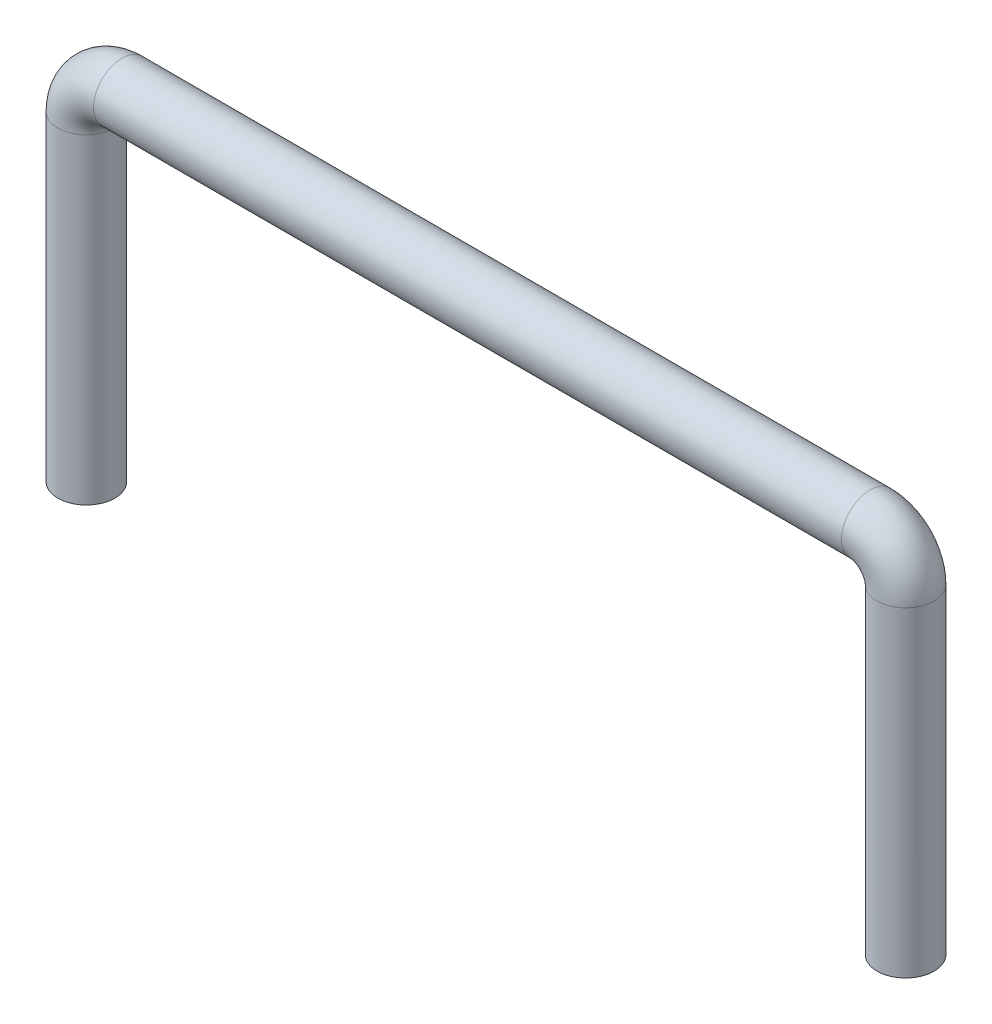
ISO-10303-21;
HEADER;
FILE_DESCRIPTION(('STEP AP214'),'2;1');
FILE_NAME('part.step','',(''),(''),'','','');
FILE_SCHEMA(('AUTOMOTIVE_DESIGN { 1 0 10303 214 1 1 1 1 }'));
ENDSEC;
DATA;
#1=APPLICATION_CONTEXT('core data for automotive mechanical design processes');
#2=APPLICATION_PROTOCOL_DEFINITION('international standard','automotive_design',2000,#1);
#3=PRODUCT_CONTEXT('',#1,'mechanical');
#4=PRODUCT('Part','Part','',(#3));
#5=PRODUCT_RELATED_PRODUCT_CATEGORY('part','',(#4));
#6=PRODUCT_DEFINITION_FORMATION('','',#4);
#7=PRODUCT_DEFINITION_CONTEXT('part definition',#1,'design');
#8=PRODUCT_DEFINITION('design','',#6,#7);
#9=PRODUCT_DEFINITION_SHAPE('','',#8);
#10=(LENGTH_UNIT() NAMED_UNIT(*) SI_UNIT(.MILLI.,.METRE.));
#11=(NAMED_UNIT(*) PLANE_ANGLE_UNIT() SI_UNIT($,.RADIAN.));
#12=(NAMED_UNIT(*) SI_UNIT($,.STERADIAN.) SOLID_ANGLE_UNIT());
#13=UNCERTAINTY_MEASURE_WITH_UNIT(LENGTH_MEASURE(1.E-05),#10,'distance_accuracy_value','');
#14=(GEOMETRIC_REPRESENTATION_CONTEXT(3) GLOBAL_UNCERTAINTY_ASSIGNED_CONTEXT((#13)) GLOBAL_UNIT_ASSIGNED_CONTEXT((#10,
#11,#12)) REPRESENTATION_CONTEXT('',''));
#15=CARTESIAN_POINT('',(0.,0.,0.));
#16=DIRECTION('',(0.,0.,1.));
#17=DIRECTION('',(1.,0.,0.));
#18=AXIS2_PLACEMENT_3D('',#15,#16,#17);
#19=CARTESIAN_POINT('',(0.,0.,0.));
#20=DIRECTION('',(0.,1.,0.));
#21=DIRECTION('',(0.,0.,1.));
#22=AXIS2_PLACEMENT_3D('',#19,#20,#21);
#23=PLANE('',#22);
#24=CARTESIAN_POINT('',(0.,0.,0.));
#25=DIRECTION('',(0.,1.,0.));
#26=DIRECTION('',(0.,0.,1.));
#27=AXIS2_PLACEMENT_3D('',#24,#25,#26);
#28=CIRCLE('',#27,0.4);
#29=CARTESIAN_POINT('',(0.,0.,0.4));
#30=VERTEX_POINT('',#29);
#31=EDGE_CURVE('E64',#30,#30,#28,.T.);
#32=ORIENTED_EDGE('',*,*,#31,.F.);
#33=EDGE_LOOP('',(#32));
#34=FACE_BOUND('',#33,.T.);
#35=ADVANCED_FACE('F37',(#34),#23,.F.);
#36=CARTESIAN_POINT('',(11.5,0.,0.));
#37=DIRECTION('',(0.,-1.,0.));
#38=DIRECTION('',(0.,0.,1.));
#39=AXIS2_PLACEMENT_3D('',#36,#37,#38);
#40=PLANE('',#39);
#41=CARTESIAN_POINT('',(11.5,0.,0.));
#42=DIRECTION('',(0.,-1.,0.));
#43=DIRECTION('',(0.,0.,1.));
#44=AXIS2_PLACEMENT_3D('',#41,#42,#43);
#45=CIRCLE('',#44,0.4);
#46=CARTESIAN_POINT('',(11.5,0.,0.4));
#47=VERTEX_POINT('',#46);
#48=EDGE_CURVE('E10',#47,#47,#45,.T.);
#49=ORIENTED_EDGE('',*,*,#48,.T.);
#50=EDGE_LOOP('',(#49));
#51=FACE_BOUND('',#50,.T.);
#52=ADVANCED_FACE('F72',(#51),#40,.T.);
#53=CARTESIAN_POINT('',(0.,0.,0.));
#54=DIRECTION('',(0.,1.,0.));
#55=DIRECTION('',(0.,0.,1.));
#56=AXIS2_PLACEMENT_3D('',#53,#54,#55);
#57=CYLINDRICAL_SURFACE('',#56,0.4);
#58=CARTESIAN_POINT('',(0.,4.5,0.));
#59=DIRECTION('',(0.,1.,0.));
#60=DIRECTION('',(0.,0.,1.));
#61=AXIS2_PLACEMENT_3D('',#58,#59,#60);
#62=CIRCLE('',#61,0.4);
#63=CARTESIAN_POINT('',(-0.4,4.49999999999999,0.));
#64=VERTEX_POINT('',#63);
#65=EDGE_CURVE('E60',#64,#64,#62,.T.);
#66=ORIENTED_EDGE('',*,*,#65,.F.);
#67=EDGE_LOOP('',(#66));
#68=FACE_BOUND('',#67,.T.);
#69=ORIENTED_EDGE('',*,*,#31,.T.);
#70=EDGE_LOOP('',(#69));
#71=FACE_BOUND('',#70,.T.);
#72=ADVANCED_FACE('F69',(#68,#71),#57,.T.);
#73=CARTESIAN_POINT('',(0.5,4.5,0.));
#74=DIRECTION('',(0.,0.,-1.));
#75=DIRECTION('',(-1.,0.,0.));
#76=AXIS2_PLACEMENT_3D('',#73,#74,#75);
#77=TOROIDAL_SURFACE('',#76,0.5,0.4);
#78=CARTESIAN_POINT('',(0.500000000000003,5.,0.));
#79=DIRECTION('',(1.,0.,0.));
#80=DIRECTION('',(0.,0.,1.));
#81=AXIS2_PLACEMENT_3D('',#78,#79,#80);
#82=CIRCLE('',#81,0.4);
#83=CARTESIAN_POINT('',(0.500000000000006,5.4,0.));
#84=VERTEX_POINT('',#83);
#85=EDGE_CURVE('E54',#84,#84,#82,.T.);
#86=CARTESIAN_POINT('',(0.5,4.5,0.));
#87=DIRECTION('',(0.,0.,-1.));
#88=DIRECTION('',(-1.,0.,0.));
#89=AXIS2_PLACEMENT_3D('',#86,#87,#88);
#90=CIRCLE('',#89,0.9);
#91=EDGE_CURVE('',#64,#84,#90,.T.);
#92=ORIENTED_EDGE('',*,*,#65,.T.);
#93=ORIENTED_EDGE('',*,*,#85,.F.);
#94=ORIENTED_EDGE('',*,*,#91,.T.);
#95=ORIENTED_EDGE('',*,*,#91,.F.);
#96=EDGE_LOOP('',(#92,#94,#93,#95));
#97=FACE_BOUND('',#96,.T.);
#98=ADVANCED_FACE('F90',(#97),#77,.T.);
#99=CARTESIAN_POINT('',(0.500000000000003,5.,0.));
#100=DIRECTION('',(1.,0.,0.));
#101=DIRECTION('',(0.,0.,-1.));
#102=AXIS2_PLACEMENT_3D('',#99,#100,#101);
#103=CYLINDRICAL_SURFACE('',#102,0.4);
#104=CARTESIAN_POINT('',(11.,5.,0.));
#105=DIRECTION('',(1.,0.,0.));
#106=DIRECTION('',(0.,0.,1.));
#107=AXIS2_PLACEMENT_3D('',#104,#105,#106);
#108=CIRCLE('',#107,0.4);
#109=CARTESIAN_POINT('',(11.,5.4,0.));
#110=VERTEX_POINT('',#109);
#111=EDGE_CURVE('E49',#110,#110,#108,.T.);
#112=ORIENTED_EDGE('',*,*,#111,.F.);
#113=EDGE_LOOP('',(#112));
#114=FACE_BOUND('',#113,.T.);
#115=ORIENTED_EDGE('',*,*,#85,.T.);
#116=EDGE_LOOP('',(#115));
#117=FACE_BOUND('',#116,.T.);
#118=ADVANCED_FACE('F84',(#114,#117),#103,.T.);
#119=CARTESIAN_POINT('',(11.,4.5,0.));
#120=DIRECTION('',(0.,0.,-1.));
#121=DIRECTION('',(-1.,0.,0.));
#122=AXIS2_PLACEMENT_3D('',#119,#120,#121);
#123=TOROIDAL_SURFACE('',#122,0.5,0.4);
#124=CARTESIAN_POINT('',(11.5,4.5,0.));
#125=DIRECTION('',(0.,-1.,0.));
#126=DIRECTION('',(0.,0.,1.));
#127=AXIS2_PLACEMENT_3D('',#124,#125,#126);
#128=CIRCLE('',#127,0.4);
#129=CARTESIAN_POINT('',(11.9,4.49999999999999,0.));
#130=VERTEX_POINT('',#129);
#131=EDGE_CURVE('E44',#130,#130,#128,.T.);
#132=CARTESIAN_POINT('',(11.,4.5,0.));
#133=DIRECTION('',(0.,0.,-1.));
#134=DIRECTION('',(-1.,0.,0.));
#135=AXIS2_PLACEMENT_3D('',#132,#133,#134);
#136=CIRCLE('',#135,0.9);
#137=EDGE_CURVE('',#110,#130,#136,.T.);
#138=ORIENTED_EDGE('',*,*,#111,.T.);
#139=ORIENTED_EDGE('',*,*,#131,.F.);
#140=ORIENTED_EDGE('',*,*,#137,.T.);
#141=ORIENTED_EDGE('',*,*,#137,.F.);
#142=EDGE_LOOP('',(#138,#140,#139,#141));
#143=FACE_BOUND('',#142,.T.);
#144=ADVANCED_FACE('F78',(#143),#123,.T.);
#145=CARTESIAN_POINT('',(11.5,4.5,0.));
#146=DIRECTION('',(0.,-1.,0.));
#147=DIRECTION('',(1.,0.,0.));
#148=AXIS2_PLACEMENT_3D('',#145,#146,#147);
#149=CYLINDRICAL_SURFACE('',#148,0.4);
#150=ORIENTED_EDGE('',*,*,#48,.F.);
#151=EDGE_LOOP('',(#150));
#152=FACE_BOUND('',#151,.T.);
#153=ORIENTED_EDGE('',*,*,#131,.T.);
#154=EDGE_LOOP('',(#153));
#155=FACE_BOUND('',#154,.T.);
#156=ADVANCED_FACE('F76',(#152,#155),#149,.T.);
#157=CLOSED_SHELL('',(#35,#52,#72,#98,#118,#144,#156));
#158=MANIFOLD_SOLID_BREP('B2',#157);
#159=ADVANCED_BREP_SHAPE_REPRESENTATION('',(#18,#158),#14);
#160=SHAPE_DEFINITION_REPRESENTATION(#9,#159);
ENDSEC;
END-ISO-10303-21;
